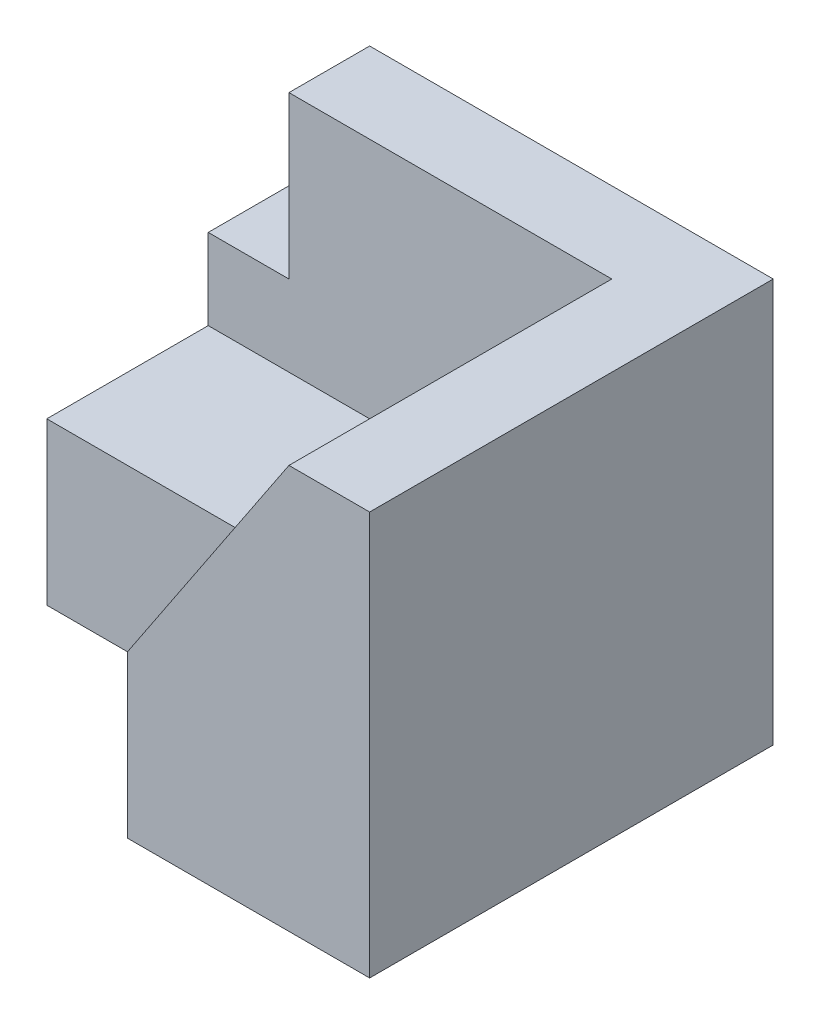
ISO-10303-21;
HEADER;
FILE_DESCRIPTION(('STEP AP214'),'2;1');
FILE_NAME('part.step','',(''),(''),'','','');
FILE_SCHEMA(('AUTOMOTIVE_DESIGN { 1 0 10303 214 1 1 1 1 }'));
ENDSEC;
DATA;
#1=APPLICATION_CONTEXT('core data for automotive mechanical design processes');
#2=APPLICATION_PROTOCOL_DEFINITION('international standard','automotive_design',2000,#1);
#3=PRODUCT_CONTEXT('',#1,'mechanical');
#4=PRODUCT('Part','Part','',(#3));
#5=PRODUCT_RELATED_PRODUCT_CATEGORY('part','',(#4));
#6=PRODUCT_DEFINITION_FORMATION('','',#4);
#7=PRODUCT_DEFINITION_CONTEXT('part definition',#1,'design');
#8=PRODUCT_DEFINITION('design','',#6,#7);
#9=PRODUCT_DEFINITION_SHAPE('','',#8);
#10=(LENGTH_UNIT() NAMED_UNIT(*) SI_UNIT(.MILLI.,.METRE.));
#11=(NAMED_UNIT(*) PLANE_ANGLE_UNIT() SI_UNIT($,.RADIAN.));
#12=(NAMED_UNIT(*) SI_UNIT($,.STERADIAN.) SOLID_ANGLE_UNIT());
#13=UNCERTAINTY_MEASURE_WITH_UNIT(LENGTH_MEASURE(1.E-05),#10,'distance_accuracy_value','');
#14=(GEOMETRIC_REPRESENTATION_CONTEXT(3) GLOBAL_UNCERTAINTY_ASSIGNED_CONTEXT((#13)) GLOBAL_UNIT_ASSIGNED_CONTEXT((#10,
#11,#12)) REPRESENTATION_CONTEXT('',''));
#15=CARTESIAN_POINT('',(0.,0.,0.));
#16=DIRECTION('',(0.,0.,1.));
#17=DIRECTION('',(1.,0.,0.));
#18=AXIS2_PLACEMENT_3D('',#15,#16,#17);
#19=CARTESIAN_POINT('',(0.,0.,50.));
#20=DIRECTION('',(1.,0.,0.));
#21=DIRECTION('',(0.,0.,-1.));
#22=AXIS2_PLACEMENT_3D('',#19,#20,#21);
#23=PLANE('',#22);
#24=DIRECTION('',(0.,-1.,0.));
#25=VECTOR('',#24,1.);
#26=CARTESIAN_POINT('',(0.,0.,30.));
#27=LINE('',#26,#25);
#28=CARTESIAN_POINT('',(0.,20.,30.));
#29=VERTEX_POINT('',#28);
#30=CARTESIAN_POINT('',(0.,0.,30.));
#31=VERTEX_POINT('',#30);
#32=EDGE_CURVE('E152',#29,#31,#27,.T.);
#33=ORIENTED_EDGE('',*,*,#32,.F.);
#34=DIRECTION('',(0.,0.,1.));
#35=VECTOR('',#34,1.);
#36=CARTESIAN_POINT('',(0.,20.,10.));
#37=LINE('',#36,#35);
#38=CARTESIAN_POINT('',(0.,20.,10.));
#39=VERTEX_POINT('',#38);
#40=EDGE_CURVE('E148',#39,#29,#37,.T.);
#41=ORIENTED_EDGE('',*,*,#40,.F.);
#42=DIRECTION('',(0.,-1.,0.));
#43=VECTOR('',#42,1.);
#44=CARTESIAN_POINT('',(0.,30.,10.));
#45=LINE('',#44,#43);
#46=CARTESIAN_POINT('',(0.,30.,10.));
#47=VERTEX_POINT('',#46);
#48=EDGE_CURVE('E125',#47,#39,#45,.T.);
#49=ORIENTED_EDGE('',*,*,#48,.F.);
#50=DIRECTION('',(0.,0.,1.));
#51=VECTOR('',#50,1.);
#52=CARTESIAN_POINT('',(0.,30.,0.));
#53=LINE('',#52,#51);
#54=CARTESIAN_POINT('',(0.,30.,0.));
#55=VERTEX_POINT('',#54);
#56=EDGE_CURVE('E169',#55,#47,#53,.T.);
#57=ORIENTED_EDGE('',*,*,#56,.F.);
#58=DIRECTION('',(0.,-1.,0.));
#59=VECTOR('',#58,1.);
#60=CARTESIAN_POINT('',(0.,0.,0.));
#61=LINE('',#60,#59);
#62=CARTESIAN_POINT('',(0.,0.,0.));
#63=VERTEX_POINT('',#62);
#64=EDGE_CURVE('E173',#55,#63,#61,.T.);
#65=ORIENTED_EDGE('',*,*,#64,.T.);
#66=DIRECTION('',(0.,0.,-1.));
#67=VECTOR('',#66,1.);
#68=CARTESIAN_POINT('',(0.,0.,50.));
#69=LINE('',#68,#67);
#70=EDGE_CURVE('E11',#31,#63,#69,.T.);
#71=ORIENTED_EDGE('',*,*,#70,.F.);
#72=EDGE_LOOP('',(#33,#41,#49,#57,#65,#71));
#73=FACE_BOUND('',#72,.T.);
#74=ADVANCED_FACE('F35',(#73),#23,.F.);
#75=CARTESIAN_POINT('',(0.,0.,50.));
#76=DIRECTION('',(0.,1.,0.));
#77=DIRECTION('',(0.,0.,1.));
#78=AXIS2_PLACEMENT_3D('',#75,#76,#77);
#79=PLANE('',#78);
#80=DIRECTION('',(1.,0.,0.));
#81=VECTOR('',#80,1.);
#82=CARTESIAN_POINT('',(0.,0.,50.));
#83=LINE('',#82,#81);
#84=CARTESIAN_POINT('',(30.,0.,50.));
#85=VERTEX_POINT('',#84);
#86=CARTESIAN_POINT('',(60.,0.,50.));
#87=VERTEX_POINT('',#86);
#88=EDGE_CURVE('E178',#85,#87,#83,.T.);
#89=ORIENTED_EDGE('',*,*,#88,.F.);
#90=DIRECTION('',(0.,0.,1.));
#91=VECTOR('',#90,1.);
#92=CARTESIAN_POINT('',(30.,0.,30.));
#93=LINE('',#92,#91);
#94=CARTESIAN_POINT('',(30.,0.,30.));
#95=VERTEX_POINT('',#94);
#96=EDGE_CURVE('E49',#95,#85,#93,.T.);
#97=ORIENTED_EDGE('',*,*,#96,.F.);
#98=DIRECTION('',(1.,0.,0.));
#99=VECTOR('',#98,1.);
#100=CARTESIAN_POINT('',(0.,0.,30.));
#101=LINE('',#100,#99);
#102=EDGE_CURVE('E154',#31,#95,#101,.T.);
#103=ORIENTED_EDGE('',*,*,#102,.F.);
#104=ORIENTED_EDGE('',*,*,#70,.T.);
#105=DIRECTION('',(1.,0.,0.));
#106=VECTOR('',#105,1.);
#107=CARTESIAN_POINT('',(0.,0.,0.));
#108=LINE('',#107,#106);
#109=CARTESIAN_POINT('',(60.,0.,0.));
#110=VERTEX_POINT('',#109);
#111=EDGE_CURVE('E189',#63,#110,#108,.T.);
#112=ORIENTED_EDGE('',*,*,#111,.T.);
#113=DIRECTION('',(0.,0.,-1.));
#114=VECTOR('',#113,1.);
#115=CARTESIAN_POINT('',(60.,0.,50.));
#116=LINE('',#115,#114);
#117=EDGE_CURVE('E42',#87,#110,#116,.T.);
#118=ORIENTED_EDGE('',*,*,#117,.F.);
#119=EDGE_LOOP('',(#89,#97,#103,#104,#112,#118));
#120=FACE_BOUND('',#119,.T.);
#121=ADVANCED_FACE('F216',(#120),#79,.F.);
#122=CARTESIAN_POINT('',(60.,0.,50.));
#123=DIRECTION('',(-1.,0.,0.));
#124=DIRECTION('',(0.,0.,1.));
#125=AXIS2_PLACEMENT_3D('',#122,#123,#124);
#126=PLANE('',#125);
#127=DIRECTION('',(0.,1.,0.));
#128=VECTOR('',#127,1.);
#129=CARTESIAN_POINT('',(60.,0.,0.));
#130=LINE('',#129,#128);
#131=CARTESIAN_POINT('',(60.,50.,0.));
#132=VERTEX_POINT('',#131);
#133=EDGE_CURVE('E191',#110,#132,#130,.T.);
#134=ORIENTED_EDGE('',*,*,#133,.T.);
#135=DIRECTION('',(0.,0.,-1.));
#136=VECTOR('',#135,1.);
#137=CARTESIAN_POINT('',(60.,50.,50.));
#138=LINE('',#137,#136);
#139=CARTESIAN_POINT('',(60.,50.,50.));
#140=VERTEX_POINT('',#139);
#141=EDGE_CURVE('E186',#140,#132,#138,.T.);
#142=ORIENTED_EDGE('',*,*,#141,.F.);
#143=DIRECTION('',(0.,1.,0.));
#144=VECTOR('',#143,1.);
#145=CARTESIAN_POINT('',(60.,0.,50.));
#146=LINE('',#145,#144);
#147=EDGE_CURVE('E180',#87,#140,#146,.T.);
#148=ORIENTED_EDGE('',*,*,#147,.F.);
#149=ORIENTED_EDGE('',*,*,#117,.T.);
#150=EDGE_LOOP('',(#134,#142,#148,#149));
#151=FACE_BOUND('',#150,.T.);
#152=ADVANCED_FACE('F201',(#151),#126,.F.);
#153=CARTESIAN_POINT('',(0.,50.,50.));
#154=DIRECTION('',(0.,-1.,0.));
#155=DIRECTION('',(0.,0.,-1.));
#156=AXIS2_PLACEMENT_3D('',#153,#154,#155);
#157=PLANE('',#156);
#158=DIRECTION('',(-1.,0.,0.));
#159=VECTOR('',#158,1.);
#160=CARTESIAN_POINT('',(50.,50.,10.));
#161=LINE('',#160,#159);
#162=CARTESIAN_POINT('',(50.,50.,10.));
#163=VERTEX_POINT('',#162);
#164=CARTESIAN_POINT('',(10.,50.,10.));
#165=VERTEX_POINT('',#164);
#166=EDGE_CURVE('E133',#163,#165,#161,.T.);
#167=ORIENTED_EDGE('',*,*,#166,.F.);
#168=DIRECTION('',(0.,0.,1.));
#169=VECTOR('',#168,1.);
#170=CARTESIAN_POINT('',(50.,50.,10.));
#171=LINE('',#170,#169);
#172=CARTESIAN_POINT('',(50.,50.,50.));
#173=VERTEX_POINT('',#172);
#174=EDGE_CURVE('E124',#163,#173,#171,.T.);
#175=ORIENTED_EDGE('',*,*,#174,.T.);
#176=DIRECTION('',(-1.,0.,0.));
#177=VECTOR('',#176,1.);
#178=CARTESIAN_POINT('',(0.,50.,50.));
#179=LINE('',#178,#177);
#180=EDGE_CURVE('E183',#140,#173,#179,.T.);
#181=ORIENTED_EDGE('',*,*,#180,.F.);
#182=ORIENTED_EDGE('',*,*,#141,.T.);
#183=DIRECTION('',(-1.,0.,0.));
#184=VECTOR('',#183,1.);
#185=CARTESIAN_POINT('',(0.,50.,0.));
#186=LINE('',#185,#184);
#187=CARTESIAN_POINT('',(10.,50.,0.));
#188=VERTEX_POINT('',#187);
#189=EDGE_CURVE('E181',#132,#188,#186,.T.);
#190=ORIENTED_EDGE('',*,*,#189,.T.);
#191=DIRECTION('',(0.,0.,1.));
#192=VECTOR('',#191,1.);
#193=CARTESIAN_POINT('',(10.,50.,0.));
#194=LINE('',#193,#192);
#195=EDGE_CURVE('E170',#188,#165,#194,.T.);
#196=ORIENTED_EDGE('',*,*,#195,.T.);
#197=EDGE_LOOP('',(#167,#175,#181,#182,#190,#196));
#198=FACE_BOUND('',#197,.T.);
#199=ADVANCED_FACE('F211',(#198),#157,.F.);
#200=CARTESIAN_POINT('',(0.,0.,50.));
#201=DIRECTION('',(0.,0.,-1.));
#202=DIRECTION('',(-1.,0.,0.));
#203=AXIS2_PLACEMENT_3D('',#200,#201,#202);
#204=PLANE('',#203);
#205=ORIENTED_EDGE('',*,*,#180,.T.);
#206=DIRECTION('',(0.554700196225229,0.832050294337844,0.));
#207=VECTOR('',#206,1.);
#208=CARTESIAN_POINT('',(30.,20.,50.));
#209=LINE('',#208,#207);
#210=CARTESIAN_POINT('',(30.,20.,50.));
#211=VERTEX_POINT('',#210);
#212=EDGE_CURVE('E138',#211,#173,#209,.T.);
#213=ORIENTED_EDGE('',*,*,#212,.F.);
#214=DIRECTION('',(0.,1.,0.));
#215=VECTOR('',#214,1.);
#216=CARTESIAN_POINT('',(30.,0.,50.));
#217=LINE('',#216,#215);
#218=EDGE_CURVE('E150',#85,#211,#217,.T.);
#219=ORIENTED_EDGE('',*,*,#218,.F.);
#220=ORIENTED_EDGE('',*,*,#88,.T.);
#221=ORIENTED_EDGE('',*,*,#147,.T.);
#222=EDGE_LOOP('',(#205,#213,#219,#220,#221));
#223=FACE_BOUND('',#222,.T.);
#224=ADVANCED_FACE('F215',(#223),#204,.F.);
#225=CARTESIAN_POINT('',(0.,0.,0.));
#226=DIRECTION('',(0.,0.,-1.));
#227=DIRECTION('',(-1.,0.,0.));
#228=AXIS2_PLACEMENT_3D('',#225,#226,#227);
#229=PLANE('',#228);
#230=DIRECTION('',(0.,1.,0.));
#231=VECTOR('',#230,1.);
#232=CARTESIAN_POINT('',(10.,50.,0.));
#233=LINE('',#232,#231);
#234=CARTESIAN_POINT('',(10.,30.,0.));
#235=VERTEX_POINT('',#234);
#236=EDGE_CURVE('E57',#235,#188,#233,.T.);
#237=ORIENTED_EDGE('',*,*,#236,.T.);
#238=ORIENTED_EDGE('',*,*,#189,.F.);
#239=ORIENTED_EDGE('',*,*,#133,.F.);
#240=ORIENTED_EDGE('',*,*,#111,.F.);
#241=ORIENTED_EDGE('',*,*,#64,.F.);
#242=DIRECTION('',(1.,0.,0.));
#243=VECTOR('',#242,1.);
#244=CARTESIAN_POINT('',(0.,30.,0.));
#245=LINE('',#244,#243);
#246=EDGE_CURVE('E164',#55,#235,#245,.T.);
#247=ORIENTED_EDGE('',*,*,#246,.T.);
#248=EDGE_LOOP('',(#237,#238,#239,#240,#241,#247));
#249=FACE_BOUND('',#248,.T.);
#250=ADVANCED_FACE('F208',(#249),#229,.T.);
#251=CARTESIAN_POINT('',(10.,50.,0.));
#252=DIRECTION('',(1.,0.,0.));
#253=DIRECTION('',(0.,0.,-1.));
#254=AXIS2_PLACEMENT_3D('',#251,#252,#253);
#255=PLANE('',#254);
#256=DIRECTION('',(0.,0.,1.));
#257=VECTOR('',#256,1.);
#258=CARTESIAN_POINT('',(10.,30.,0.));
#259=LINE('',#258,#257);
#260=CARTESIAN_POINT('',(10.,30.,10.));
#261=VERTEX_POINT('',#260);
#262=EDGE_CURVE('E174',#235,#261,#259,.T.);
#263=ORIENTED_EDGE('',*,*,#262,.T.);
#264=DIRECTION('',(0.,-1.,0.));
#265=VECTOR('',#264,1.);
#266=CARTESIAN_POINT('',(10.,50.,10.));
#267=LINE('',#266,#265);
#268=EDGE_CURVE('E143',#165,#261,#267,.T.);
#269=ORIENTED_EDGE('',*,*,#268,.F.);
#270=ORIENTED_EDGE('',*,*,#195,.F.);
#271=ORIENTED_EDGE('',*,*,#236,.F.);
#272=EDGE_LOOP('',(#263,#269,#270,#271));
#273=FACE_BOUND('',#272,.T.);
#274=ADVANCED_FACE('F227',(#273),#255,.F.);
#275=CARTESIAN_POINT('',(0.,30.,0.));
#276=DIRECTION('',(0.,-1.,0.));
#277=DIRECTION('',(0.,0.,-1.));
#278=AXIS2_PLACEMENT_3D('',#275,#276,#277);
#279=PLANE('',#278);
#280=ORIENTED_EDGE('',*,*,#56,.T.);
#281=DIRECTION('',(-1.,0.,0.));
#282=VECTOR('',#281,1.);
#283=CARTESIAN_POINT('',(10.,30.,10.));
#284=LINE('',#283,#282);
#285=EDGE_CURVE('E145',#261,#47,#284,.T.);
#286=ORIENTED_EDGE('',*,*,#285,.F.);
#287=ORIENTED_EDGE('',*,*,#262,.F.);
#288=ORIENTED_EDGE('',*,*,#246,.F.);
#289=EDGE_LOOP('',(#280,#286,#287,#288));
#290=FACE_BOUND('',#289,.T.);
#291=ADVANCED_FACE('F224',(#290),#279,.F.);
#292=CARTESIAN_POINT('',(30.,0.,30.));
#293=DIRECTION('',(1.,0.,0.));
#294=DIRECTION('',(0.,0.,-1.));
#295=AXIS2_PLACEMENT_3D('',#292,#293,#294);
#296=PLANE('',#295);
#297=ORIENTED_EDGE('',*,*,#218,.T.);
#298=DIRECTION('',(0.,0.,1.));
#299=VECTOR('',#298,1.);
#300=CARTESIAN_POINT('',(30.,20.,30.));
#301=LINE('',#300,#299);
#302=CARTESIAN_POINT('',(30.,20.,30.));
#303=VERTEX_POINT('',#302);
#304=EDGE_CURVE('E162',#303,#211,#301,.T.);
#305=ORIENTED_EDGE('',*,*,#304,.F.);
#306=DIRECTION('',(0.,1.,0.));
#307=VECTOR('',#306,1.);
#308=CARTESIAN_POINT('',(30.,0.,30.));
#309=LINE('',#308,#307);
#310=EDGE_CURVE('E157',#95,#303,#309,.T.);
#311=ORIENTED_EDGE('',*,*,#310,.F.);
#312=ORIENTED_EDGE('',*,*,#96,.T.);
#313=EDGE_LOOP('',(#297,#305,#311,#312));
#314=FACE_BOUND('',#313,.T.);
#315=ADVANCED_FACE('F229',(#314),#296,.F.);
#316=CARTESIAN_POINT('',(0.,0.,30.));
#317=DIRECTION('',(0.,0.,-1.));
#318=DIRECTION('',(-1.,0.,0.));
#319=AXIS2_PLACEMENT_3D('',#316,#317,#318);
#320=PLANE('',#319);
#321=ORIENTED_EDGE('',*,*,#32,.T.);
#322=ORIENTED_EDGE('',*,*,#102,.T.);
#323=ORIENTED_EDGE('',*,*,#310,.T.);
#324=DIRECTION('',(-1.,0.,0.));
#325=VECTOR('',#324,1.);
#326=CARTESIAN_POINT('',(0.,20.,30.));
#327=LINE('',#326,#325);
#328=EDGE_CURVE('E121',#303,#29,#327,.T.);
#329=ORIENTED_EDGE('',*,*,#328,.T.);
#330=EDGE_LOOP('',(#321,#322,#323,#329));
#331=FACE_BOUND('',#330,.T.);
#332=ADVANCED_FACE('F228',(#331),#320,.F.);
#333=CARTESIAN_POINT('',(0.,20.,10.));
#334=DIRECTION('',(0.,-1.,0.));
#335=DIRECTION('',(0.,0.,-1.));
#336=AXIS2_PLACEMENT_3D('',#333,#334,#335);
#337=PLANE('',#336);
#338=DIRECTION('',(0.,0.,1.));
#339=VECTOR('',#338,1.);
#340=CARTESIAN_POINT('',(30.,20.,10.));
#341=LINE('',#340,#339);
#342=CARTESIAN_POINT('',(30.,20.,10.));
#343=VERTEX_POINT('',#342);
#344=EDGE_CURVE('E114',#343,#303,#341,.T.);
#345=ORIENTED_EDGE('',*,*,#344,.F.);
#346=DIRECTION('',(1.,0.,0.));
#347=VECTOR('',#346,1.);
#348=CARTESIAN_POINT('',(0.,20.,10.));
#349=LINE('',#348,#347);
#350=EDGE_CURVE('E118',#39,#343,#349,.T.);
#351=ORIENTED_EDGE('',*,*,#350,.F.);
#352=ORIENTED_EDGE('',*,*,#40,.T.);
#353=ORIENTED_EDGE('',*,*,#328,.F.);
#354=EDGE_LOOP('',(#345,#351,#352,#353));
#355=FACE_BOUND('',#354,.T.);
#356=ADVANCED_FACE('F116',(#355),#337,.F.);
#357=CARTESIAN_POINT('',(30.,20.,10.));
#358=DIRECTION('',(0.832050294337844,-0.554700196225229,0.));
#359=DIRECTION('',(0.554700196225229,0.832050294337844,0.));
#360=AXIS2_PLACEMENT_3D('',#357,#358,#359);
#361=PLANE('',#360);
#362=ORIENTED_EDGE('',*,*,#212,.T.);
#363=ORIENTED_EDGE('',*,*,#174,.F.);
#364=DIRECTION('',(0.554700196225229,0.832050294337844,0.));
#365=VECTOR('',#364,1.);
#366=CARTESIAN_POINT('',(30.,20.,10.));
#367=LINE('',#366,#365);
#368=EDGE_CURVE('E128',#343,#163,#367,.T.);
#369=ORIENTED_EDGE('',*,*,#368,.F.);
#370=ORIENTED_EDGE('',*,*,#344,.T.);
#371=ORIENTED_EDGE('',*,*,#304,.T.);
#372=EDGE_LOOP('',(#362,#363,#369,#370,#371));
#373=FACE_BOUND('',#372,.T.);
#374=ADVANCED_FACE('F129',(#373),#361,.F.);
#375=CARTESIAN_POINT('',(0.,0.,10.));
#376=DIRECTION('',(0.,0.,-1.));
#377=DIRECTION('',(-1.,0.,0.));
#378=AXIS2_PLACEMENT_3D('',#375,#376,#377);
#379=PLANE('',#378);
#380=ORIENTED_EDGE('',*,*,#350,.T.);
#381=ORIENTED_EDGE('',*,*,#368,.T.);
#382=ORIENTED_EDGE('',*,*,#166,.T.);
#383=ORIENTED_EDGE('',*,*,#268,.T.);
#384=ORIENTED_EDGE('',*,*,#285,.T.);
#385=ORIENTED_EDGE('',*,*,#48,.T.);
#386=EDGE_LOOP('',(#380,#381,#382,#383,#384,#385));
#387=FACE_BOUND('',#386,.T.);
#388=ADVANCED_FACE('F135',(#387),#379,.F.);
#389=CLOSED_SHELL('',(#74,#121,#152,#199,#224,#250,#274,#291,#315,#332,#356,#374,#388));
#390=MANIFOLD_SOLID_BREP('B2',#389);
#391=ADVANCED_BREP_SHAPE_REPRESENTATION('',(#18,#390),#14);
#392=SHAPE_DEFINITION_REPRESENTATION(#9,#391);
ENDSEC;
END-ISO-10303-21;
